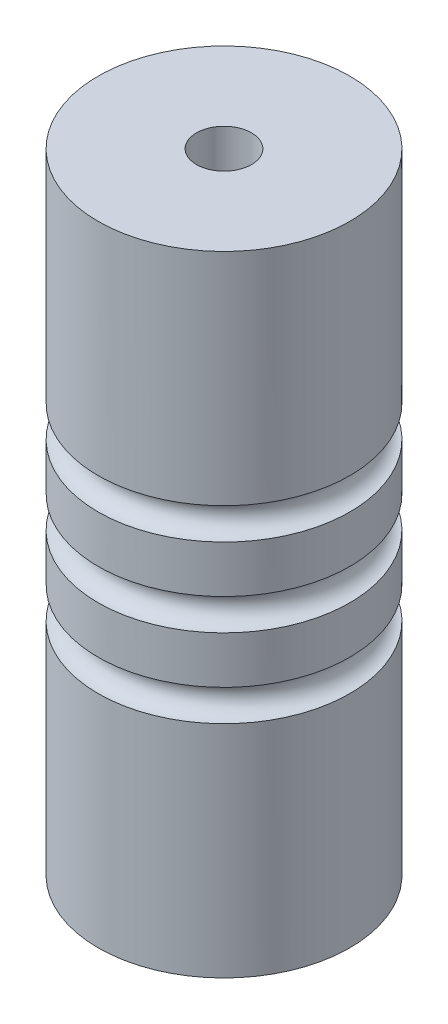
ISO-10303-21;
HEADER;
FILE_DESCRIPTION(('STEP AP214'),'2;1');
FILE_NAME('part.step','',(''),(''),'','','');
FILE_SCHEMA(('AUTOMOTIVE_DESIGN { 1 0 10303 214 1 1 1 1 }'));
ENDSEC;
DATA;
#1=APPLICATION_CONTEXT('core data for automotive mechanical design processes');
#2=APPLICATION_PROTOCOL_DEFINITION('international standard','automotive_design',2000,#1);
#3=PRODUCT_CONTEXT('',#1,'mechanical');
#4=PRODUCT('Part','Part','',(#3));
#5=PRODUCT_RELATED_PRODUCT_CATEGORY('part','',(#4));
#6=PRODUCT_DEFINITION_FORMATION('','',#4);
#7=PRODUCT_DEFINITION_CONTEXT('part definition',#1,'design');
#8=PRODUCT_DEFINITION('design','',#6,#7);
#9=PRODUCT_DEFINITION_SHAPE('','',#8);
#10=(LENGTH_UNIT() NAMED_UNIT(*) SI_UNIT(.MILLI.,.METRE.));
#11=(NAMED_UNIT(*) PLANE_ANGLE_UNIT() SI_UNIT($,.RADIAN.));
#12=(NAMED_UNIT(*) SI_UNIT($,.STERADIAN.) SOLID_ANGLE_UNIT());
#13=UNCERTAINTY_MEASURE_WITH_UNIT(LENGTH_MEASURE(1.E-05),#10,'distance_accuracy_value','');
#14=(GEOMETRIC_REPRESENTATION_CONTEXT(3) GLOBAL_UNCERTAINTY_ASSIGNED_CONTEXT((#13)) GLOBAL_UNIT_ASSIGNED_CONTEXT((#10,
#11,#12)) REPRESENTATION_CONTEXT('',''));
#15=CARTESIAN_POINT('',(0.,0.,0.));
#16=DIRECTION('',(0.,0.,1.));
#17=DIRECTION('',(1.,0.,0.));
#18=AXIS2_PLACEMENT_3D('',#15,#16,#17);
#19=CARTESIAN_POINT('',(0.,40.,0.));
#20=DIRECTION('',(0.,-1.,0.));
#21=DIRECTION('',(0.,0.,-1.));
#22=AXIS2_PLACEMENT_3D('',#19,#20,#21);
#23=CYLINDRICAL_SURFACE('',#22,8.);
#24=CARTESIAN_POINT('',(0.,14.,0.));
#25=DIRECTION('',(0.,1.,0.));
#26=DIRECTION('',(0.,0.,1.));
#27=AXIS2_PLACEMENT_3D('',#24,#25,#26);
#28=CIRCLE('',#27,8.);
#29=CARTESIAN_POINT('',(0.,14.,8.));
#30=VERTEX_POINT('',#29);
#31=EDGE_CURVE('E33',#30,#30,#28,.F.);
#32=ORIENTED_EDGE('',*,*,#31,.T.);
#33=EDGE_LOOP('',(#32));
#34=FACE_BOUND('',#33,.T.);
#35=CARTESIAN_POINT('',(0.,0.,0.));
#36=DIRECTION('',(0.,1.,0.));
#37=DIRECTION('',(0.,0.,1.));
#38=AXIS2_PLACEMENT_3D('',#35,#36,#37);
#39=CIRCLE('',#38,8.);
#40=CARTESIAN_POINT('',(0.,0.,8.));
#41=VERTEX_POINT('',#40);
#42=EDGE_CURVE('E37',#41,#41,#39,.T.);
#43=ORIENTED_EDGE('',*,*,#42,.T.);
#44=EDGE_LOOP('',(#43));
#45=FACE_BOUND('',#44,.T.);
#46=ADVANCED_FACE('F29',(#34,#45),#23,.T.);
#47=CARTESIAN_POINT('',(0.,24.,0.));
#48=DIRECTION('',(0.,1.,0.));
#49=DIRECTION('',(0.,0.,1.));
#50=AXIS2_PLACEMENT_3D('',#47,#48,#49);
#51=CIRCLE('',#50,8.);
#52=CARTESIAN_POINT('',(0.,24.,8.));
#53=VERTEX_POINT('',#52);
#54=EDGE_CURVE('E55',#53,#53,#51,.F.);
#55=ORIENTED_EDGE('',*,*,#54,.T.);
#56=EDGE_LOOP('',(#55));
#57=FACE_BOUND('',#56,.T.);
#58=CARTESIAN_POINT('',(0.,21.,0.));
#59=DIRECTION('',(0.,-1.,0.));
#60=DIRECTION('',(0.,0.,-1.));
#61=AXIS2_PLACEMENT_3D('',#58,#59,#60);
#62=CIRCLE('',#61,8.);
#63=CARTESIAN_POINT('',(0.,21.,-8.));
#64=VERTEX_POINT('',#63);
#65=EDGE_CURVE('E51',#64,#64,#62,.F.);
#66=ORIENTED_EDGE('',*,*,#65,.T.);
#67=EDGE_LOOP('',(#66));
#68=FACE_BOUND('',#67,.T.);
#69=ADVANCED_FACE('F84',(#57,#68),#23,.T.);
#70=CARTESIAN_POINT('',(0.,16.,0.));
#71=DIRECTION('',(0.,-1.,0.));
#72=DIRECTION('',(0.,0.,-1.));
#73=AXIS2_PLACEMENT_3D('',#70,#71,#72);
#74=CIRCLE('',#73,8.);
#75=CARTESIAN_POINT('',(0.,16.,-8.));
#76=VERTEX_POINT('',#75);
#77=EDGE_CURVE('E63',#76,#76,#74,.F.);
#78=ORIENTED_EDGE('',*,*,#77,.T.);
#79=EDGE_LOOP('',(#78));
#80=FACE_BOUND('',#79,.T.);
#81=CARTESIAN_POINT('',(0.,19.,0.));
#82=DIRECTION('',(0.,1.,0.));
#83=DIRECTION('',(0.,0.,1.));
#84=AXIS2_PLACEMENT_3D('',#81,#82,#83);
#85=CIRCLE('',#84,8.);
#86=CARTESIAN_POINT('',(0.,19.,8.));
#87=VERTEX_POINT('',#86);
#88=EDGE_CURVE('E54',#87,#87,#85,.F.);
#89=ORIENTED_EDGE('',*,*,#88,.T.);
#90=EDGE_LOOP('',(#89));
#91=FACE_BOUND('',#90,.T.);
#92=ADVANCED_FACE('F88',(#80,#91),#23,.T.);
#93=CARTESIAN_POINT('',(0.,0.,0.));
#94=DIRECTION('',(0.,1.,0.));
#95=DIRECTION('',(0.,0.,1.));
#96=AXIS2_PLACEMENT_3D('',#93,#94,#95);
#97=CYLINDRICAL_SURFACE('',#96,1.75);
#98=CARTESIAN_POINT('',(0.,40.,0.));
#99=DIRECTION('',(0.,1.,0.));
#100=DIRECTION('',(0.,0.,1.));
#101=AXIS2_PLACEMENT_3D('',#98,#99,#100);
#102=CIRCLE('',#101,1.75);
#103=CARTESIAN_POINT('',(0.,40.,1.75));
#104=VERTEX_POINT('',#103);
#105=EDGE_CURVE('E42',#104,#104,#102,.T.);
#106=ORIENTED_EDGE('',*,*,#105,.T.);
#107=EDGE_LOOP('',(#106));
#108=FACE_BOUND('',#107,.T.);
#109=CARTESIAN_POINT('',(0.,6.35,0.));
#110=DIRECTION('',(0.,-1.,0.));
#111=DIRECTION('',(0.,0.,-1.));
#112=AXIS2_PLACEMENT_3D('',#109,#110,#111);
#113=CIRCLE('',#112,1.75);
#114=CARTESIAN_POINT('',(0.,6.35,-1.75));
#115=VERTEX_POINT('',#114);
#116=EDGE_CURVE('E47',#115,#115,#113,.F.);
#117=ORIENTED_EDGE('',*,*,#116,.F.);
#118=EDGE_LOOP('',(#117));
#119=FACE_BOUND('',#118,.T.);
#120=ADVANCED_FACE('F92',(#108,#119),#97,.F.);
#121=CARTESIAN_POINT('',(0.,26.,0.));
#122=DIRECTION('',(0.,-1.,0.));
#123=DIRECTION('',(0.,0.,-1.));
#124=AXIS2_PLACEMENT_3D('',#121,#122,#123);
#125=CIRCLE('',#124,8.);
#126=CARTESIAN_POINT('',(0.,26.,-8.));
#127=VERTEX_POINT('',#126);
#128=EDGE_CURVE('E59',#127,#127,#125,.F.);
#129=ORIENTED_EDGE('',*,*,#128,.T.);
#130=EDGE_LOOP('',(#129));
#131=FACE_BOUND('',#130,.T.);
#132=CARTESIAN_POINT('',(0.,40.,0.));
#133=DIRECTION('',(0.,1.,0.));
#134=DIRECTION('',(0.,0.,1.));
#135=AXIS2_PLACEMENT_3D('',#132,#133,#134);
#136=CIRCLE('',#135,8.);
#137=CARTESIAN_POINT('',(0.,40.,8.));
#138=VERTEX_POINT('',#137);
#139=EDGE_CURVE('E10',#138,#138,#136,.T.);
#140=ORIENTED_EDGE('',*,*,#139,.F.);
#141=EDGE_LOOP('',(#140));
#142=FACE_BOUND('',#141,.T.);
#143=ADVANCED_FACE('F31',(#131,#142),#23,.T.);
#144=CARTESIAN_POINT('',(0.,40.,0.));
#145=DIRECTION('',(0.,1.,0.));
#146=DIRECTION('',(0.,0.,1.));
#147=AXIS2_PLACEMENT_3D('',#144,#145,#146);
#148=PLANE('',#147);
#149=ORIENTED_EDGE('',*,*,#105,.F.);
#150=EDGE_LOOP('',(#149));
#151=FACE_BOUND('',#150,.T.);
#152=ORIENTED_EDGE('',*,*,#139,.T.);
#153=EDGE_LOOP('',(#152));
#154=FACE_BOUND('',#153,.T.);
#155=ADVANCED_FACE('F91',(#151,#154),#148,.T.);
#156=CARTESIAN_POINT('',(0.,0.,0.));
#157=DIRECTION('',(0.,1.,0.));
#158=DIRECTION('',(0.,0.,1.));
#159=AXIS2_PLACEMENT_3D('',#156,#157,#158);
#160=PLANE('',#159);
#161=CARTESIAN_POINT('',(0.,0.,0.));
#162=DIRECTION('',(0.,-1.,0.));
#163=DIRECTION('',(0.,0.,-1.));
#164=AXIS2_PLACEMENT_3D('',#161,#162,#163);
#165=CIRCLE('',#164,4.);
#166=CARTESIAN_POINT('',(0.,0.,-4.));
#167=VERTEX_POINT('',#166);
#168=EDGE_CURVE('E58',#167,#167,#165,.T.);
#169=ORIENTED_EDGE('',*,*,#168,.F.);
#170=EDGE_LOOP('',(#169));
#171=FACE_BOUND('',#170,.T.);
#172=ORIENTED_EDGE('',*,*,#42,.F.);
#173=EDGE_LOOP('',(#172));
#174=FACE_BOUND('',#173,.T.);
#175=ADVANCED_FACE('F98',(#171,#174),#160,.F.);
#176=CARTESIAN_POINT('',(0.,6.35,0.));
#177=DIRECTION('',(0.,-1.,0.));
#178=DIRECTION('',(0.,0.,-1.));
#179=AXIS2_PLACEMENT_3D('',#176,#177,#178);
#180=PLANE('',#179);
#181=CARTESIAN_POINT('',(0.,6.35,0.));
#182=DIRECTION('',(0.,-1.,0.));
#183=DIRECTION('',(0.,0.,-1.));
#184=AXIS2_PLACEMENT_3D('',#181,#182,#183);
#185=CIRCLE('',#184,4.);
#186=CARTESIAN_POINT('',(0.,6.35,-4.));
#187=VERTEX_POINT('',#186);
#188=EDGE_CURVE('E50',#187,#187,#185,.T.);
#189=ORIENTED_EDGE('',*,*,#188,.T.);
#190=EDGE_LOOP('',(#189));
#191=FACE_BOUND('',#190,.T.);
#192=ORIENTED_EDGE('',*,*,#116,.T.);
#193=EDGE_LOOP('',(#192));
#194=FACE_BOUND('',#193,.T.);
#195=ADVANCED_FACE('F117',(#191,#194),#180,.T.);
#196=CARTESIAN_POINT('',(0.,6.35,0.));
#197=DIRECTION('',(0.,-1.,0.));
#198=DIRECTION('',(0.,0.,-1.));
#199=AXIS2_PLACEMENT_3D('',#196,#197,#198);
#200=CYLINDRICAL_SURFACE('',#199,4.);
#201=ORIENTED_EDGE('',*,*,#188,.F.);
#202=EDGE_LOOP('',(#201));
#203=FACE_BOUND('',#202,.T.);
#204=ORIENTED_EDGE('',*,*,#168,.T.);
#205=EDGE_LOOP('',(#204));
#206=FACE_BOUND('',#205,.T.);
#207=ADVANCED_FACE('F111',(#203,#206),#200,.F.);
#208=CARTESIAN_POINT('',(0.,20.,0.));
#209=DIRECTION('',(0.,-1.,0.));
#210=DIRECTION('',(0.,0.,-1.));
#211=AXIS2_PLACEMENT_3D('',#208,#209,#210);
#212=TOROIDAL_SURFACE('',#211,8.,1.);
#213=ORIENTED_EDGE('',*,*,#65,.F.);
#214=EDGE_LOOP('',(#213));
#215=FACE_BOUND('',#214,.T.);
#216=ORIENTED_EDGE('',*,*,#88,.F.);
#217=EDGE_LOOP('',(#216));
#218=FACE_BOUND('',#217,.T.);
#219=ADVANCED_FACE('F80',(#215,#218),#212,.F.);
#220=CARTESIAN_POINT('',(0.,25.,0.));
#221=DIRECTION('',(0.,-1.,0.));
#222=DIRECTION('',(0.,0.,-1.));
#223=AXIS2_PLACEMENT_3D('',#220,#221,#222);
#224=TOROIDAL_SURFACE('',#223,8.,1.);
#225=ORIENTED_EDGE('',*,*,#128,.F.);
#226=EDGE_LOOP('',(#225));
#227=FACE_BOUND('',#226,.T.);
#228=ORIENTED_EDGE('',*,*,#54,.F.);
#229=EDGE_LOOP('',(#228));
#230=FACE_BOUND('',#229,.T.);
#231=ADVANCED_FACE('F74',(#227,#230),#224,.F.);
#232=CARTESIAN_POINT('',(0.,15.,0.));
#233=DIRECTION('',(0.,-1.,0.));
#234=DIRECTION('',(0.,0.,-1.));
#235=AXIS2_PLACEMENT_3D('',#232,#233,#234);
#236=TOROIDAL_SURFACE('',#235,8.,1.);
#237=ORIENTED_EDGE('',*,*,#77,.F.);
#238=EDGE_LOOP('',(#237));
#239=FACE_BOUND('',#238,.T.);
#240=ORIENTED_EDGE('',*,*,#31,.F.);
#241=EDGE_LOOP('',(#240));
#242=FACE_BOUND('',#241,.T.);
#243=ADVANCED_FACE('F72',(#239,#242),#236,.F.);
#244=CLOSED_SHELL('',(#46,#69,#92,#120,#143,#155,#175,#195,#207,#219,#231,#243));
#245=MANIFOLD_SOLID_BREP('B2',#244);
#246=ADVANCED_BREP_SHAPE_REPRESENTATION('',(#18,#245),#14);
#247=SHAPE_DEFINITION_REPRESENTATION(#9,#246);
ENDSEC;
END-ISO-10303-21;
